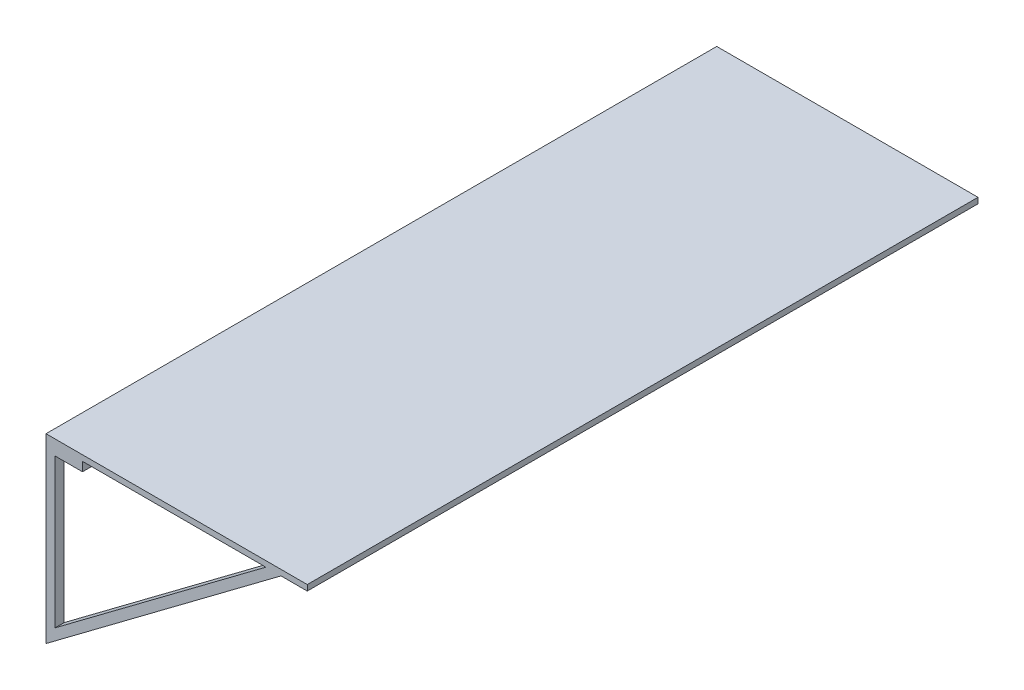
ISO-10303-21;
HEADER;
FILE_DESCRIPTION(('STEP AP214'),'2;1');
FILE_NAME('part.step','',(''),(''),'','','');
FILE_SCHEMA(('AUTOMOTIVE_DESIGN { 1 0 10303 214 1 1 1 1 }'));
ENDSEC;
DATA;
#1=APPLICATION_CONTEXT('core data for automotive mechanical design processes');
#2=APPLICATION_PROTOCOL_DEFINITION('international standard','automotive_design',2000,#1);
#3=PRODUCT_CONTEXT('',#1,'mechanical');
#4=PRODUCT('Part','Part','',(#3));
#5=PRODUCT_RELATED_PRODUCT_CATEGORY('part','',(#4));
#6=PRODUCT_DEFINITION_FORMATION('','',#4);
#7=PRODUCT_DEFINITION_CONTEXT('part definition',#1,'design');
#8=PRODUCT_DEFINITION('design','',#6,#7);
#9=PRODUCT_DEFINITION_SHAPE('','',#8);
#10=(LENGTH_UNIT() NAMED_UNIT(*) SI_UNIT(.MILLI.,.METRE.));
#11=(NAMED_UNIT(*) PLANE_ANGLE_UNIT() SI_UNIT($,.RADIAN.));
#12=(NAMED_UNIT(*) SI_UNIT($,.STERADIAN.) SOLID_ANGLE_UNIT());
#13=UNCERTAINTY_MEASURE_WITH_UNIT(LENGTH_MEASURE(1.E-05),#10,'distance_accuracy_value','');
#14=(GEOMETRIC_REPRESENTATION_CONTEXT(3) GLOBAL_UNCERTAINTY_ASSIGNED_CONTEXT((#13)) GLOBAL_UNIT_ASSIGNED_CONTEXT((#10,
#11,#12)) REPRESENTATION_CONTEXT('',''));
#15=CARTESIAN_POINT('',(0.,0.,0.));
#16=DIRECTION('',(0.,0.,1.));
#17=DIRECTION('',(1.,0.,0.));
#18=AXIS2_PLACEMENT_3D('',#15,#16,#17);
#19=CARTESIAN_POINT('',(0.,0.,1874.774));
#20=DIRECTION('',(-0.599619449043506,0.800285271842961,0.));
#21=DIRECTION('',(-0.800285271842961,-0.599619449043506,0.));
#22=AXIS2_PLACEMENT_3D('',#19,#20,#21);
#23=PLANE('',#22);
#24=DIRECTION('',(0.,0.,-1.));
#25=VECTOR('',#24,1.);
#26=CARTESIAN_POINT('',(0.,0.,1874.774));
#27=LINE('',#26,#25);
#28=CARTESIAN_POINT('',(0.,0.,950.087));
#29=VERTEX_POINT('',#28);
#30=CARTESIAN_POINT('',(0.,0.,924.687));
#31=VERTEX_POINT('',#30);
#32=EDGE_CURVE('E225',#29,#31,#27,.T.);
#33=ORIENTED_EDGE('',*,*,#32,.T.);
#34=DIRECTION('',(0.800285271842961,0.599619449043506,0.));
#35=VECTOR('',#34,1.);
#36=CARTESIAN_POINT('',(1.02853414321365E-13,0.,924.687));
#37=LINE('',#36,#35);
#38=CARTESIAN_POINT('',(656.817236388778,492.125,924.687));
#39=VERTEX_POINT('',#38);
#40=EDGE_CURVE('E208',#31,#39,#37,.T.);
#41=ORIENTED_EDGE('',*,*,#40,.T.);
#42=DIRECTION('',(0.,0.,-1.));
#43=VECTOR('',#42,1.);
#44=CARTESIAN_POINT('',(656.817236388778,492.125,1874.774));
#45=LINE('',#44,#43);
#46=CARTESIAN_POINT('',(656.817236388778,492.125,950.087));
#47=VERTEX_POINT('',#46);
#48=EDGE_CURVE('E253',#47,#39,#45,.T.);
#49=ORIENTED_EDGE('',*,*,#48,.F.);
#50=DIRECTION('',(-0.800285271842961,-0.599619449043506,0.));
#51=VECTOR('',#50,1.);
#52=CARTESIAN_POINT('',(-1.00103690639468E-13,0.,950.087));
#53=LINE('',#52,#51);
#54=EDGE_CURVE('E230',#47,#29,#53,.T.);
#55=ORIENTED_EDGE('',*,*,#54,.T.);
#56=EDGE_LOOP('',(#33,#41,#49,#55));
#57=FACE_BOUND('',#56,.T.);
#58=ADVANCED_FACE('F35',(#57),#23,.F.);
#59=CARTESIAN_POINT('',(101.981819436468,492.125,1874.774));
#60=DIRECTION('',(1.,0.,0.));
#61=DIRECTION('',(0.,0.,-1.));
#62=AXIS2_PLACEMENT_3D('',#59,#60,#61);
#63=PLANE('',#62);
#64=DIRECTION('',(0.,-1.,0.));
#65=VECTOR('',#64,1.);
#66=CARTESIAN_POINT('',(101.981819436468,492.125,924.687));
#67=LINE('',#66,#65);
#68=CARTESIAN_POINT('',(101.981819436468,492.125,924.687));
#69=VERTEX_POINT('',#68);
#70=CARTESIAN_POINT('',(101.981819436468,466.725,924.687));
#71=VERTEX_POINT('',#70);
#72=EDGE_CURVE('E219',#69,#71,#67,.T.);
#73=ORIENTED_EDGE('',*,*,#72,.F.);
#74=DIRECTION('',(0.,0.,-1.));
#75=VECTOR('',#74,1.);
#76=CARTESIAN_POINT('',(101.981819436468,492.125,1874.774));
#77=LINE('',#76,#75);
#78=CARTESIAN_POINT('',(101.981819436468,492.125,950.087));
#79=VERTEX_POINT('',#78);
#80=EDGE_CURVE('E315',#79,#69,#77,.T.);
#81=ORIENTED_EDGE('',*,*,#80,.F.);
#82=DIRECTION('',(0.,1.,0.));
#83=VECTOR('',#82,1.);
#84=CARTESIAN_POINT('',(101.981819436468,492.125,950.087));
#85=LINE('',#84,#83);
#86=CARTESIAN_POINT('',(101.981819436468,466.725,950.087));
#87=VERTEX_POINT('',#86);
#88=EDGE_CURVE('E401',#87,#79,#85,.T.);
#89=ORIENTED_EDGE('',*,*,#88,.F.);
#90=DIRECTION('',(0.,0.,-1.));
#91=VECTOR('',#90,1.);
#92=CARTESIAN_POINT('',(101.981819436468,466.725,1874.774));
#93=LINE('',#92,#91);
#94=EDGE_CURVE('E302',#87,#71,#93,.T.);
#95=ORIENTED_EDGE('',*,*,#94,.T.);
#96=EDGE_LOOP('',(#73,#81,#89,#95));
#97=FACE_BOUND('',#96,.T.);
#98=ADVANCED_FACE('F452',(#97),#63,.T.);
#99=CARTESIAN_POINT('',(101.981819436468,466.725,1874.774));
#100=DIRECTION('',(0.,-1.,0.));
#101=DIRECTION('',(0.,0.,-1.));
#102=AXIS2_PLACEMENT_3D('',#99,#100,#101);
#103=PLANE('',#102);
#104=DIRECTION('',(-1.,0.,0.));
#105=VECTOR('',#104,1.);
#106=CARTESIAN_POINT('',(101.981819436468,466.725,924.687));
#107=LINE('',#106,#105);
#108=CARTESIAN_POINT('',(25.4,466.725,924.687));
#109=VERTEX_POINT('',#108);
#110=EDGE_CURVE('E442',#71,#109,#107,.T.);
#111=ORIENTED_EDGE('',*,*,#110,.F.);
#112=ORIENTED_EDGE('',*,*,#94,.F.);
#113=DIRECTION('',(1.,0.,0.));
#114=VECTOR('',#113,1.);
#115=CARTESIAN_POINT('',(101.981819436468,466.725,950.087));
#116=LINE('',#115,#114);
#117=CARTESIAN_POINT('',(25.4,466.725,950.087));
#118=VERTEX_POINT('',#117);
#119=EDGE_CURVE('E399',#118,#87,#116,.T.);
#120=ORIENTED_EDGE('',*,*,#119,.F.);
#121=DIRECTION('',(0.,0.,-1.));
#122=VECTOR('',#121,1.);
#123=CARTESIAN_POINT('',(25.4,466.725,1874.774));
#124=LINE('',#123,#122);
#125=EDGE_CURVE('E291',#118,#109,#124,.T.);
#126=ORIENTED_EDGE('',*,*,#125,.T.);
#127=EDGE_LOOP('',(#111,#112,#120,#126));
#128=FACE_BOUND('',#127,.T.);
#129=ADVANCED_FACE('F457',(#128),#103,.T.);
#130=CARTESIAN_POINT('',(25.4,466.725,1874.774));
#131=DIRECTION('',(1.,0.,0.));
#132=DIRECTION('',(0.,1.,0.));
#133=AXIS2_PLACEMENT_3D('',#130,#131,#132);
#134=PLANE('',#133);
#135=DIRECTION('',(0.,-1.,0.));
#136=VECTOR('',#135,1.);
#137=CARTESIAN_POINT('',(25.4,466.725,924.687));
#138=LINE('',#137,#136);
#139=CARTESIAN_POINT('',(25.4000000000001,50.769813509298,924.687));
#140=VERTEX_POINT('',#139);
#141=EDGE_CURVE('E440',#109,#140,#138,.T.);
#142=ORIENTED_EDGE('',*,*,#141,.F.);
#143=ORIENTED_EDGE('',*,*,#125,.F.);
#144=DIRECTION('',(0.,1.,0.));
#145=VECTOR('',#144,1.);
#146=CARTESIAN_POINT('',(25.4,466.725,950.087));
#147=LINE('',#146,#145);
#148=CARTESIAN_POINT('',(25.4000000000001,50.769813509298,950.087));
#149=VERTEX_POINT('',#148);
#150=EDGE_CURVE('E397',#149,#118,#147,.T.);
#151=ORIENTED_EDGE('',*,*,#150,.F.);
#152=DIRECTION('',(0.,0.,-1.));
#153=VECTOR('',#152,1.);
#154=CARTESIAN_POINT('',(25.4000000000001,50.769813509298,1874.774));
#155=LINE('',#154,#153);
#156=EDGE_CURVE('E277',#149,#140,#155,.T.);
#157=ORIENTED_EDGE('',*,*,#156,.T.);
#158=EDGE_LOOP('',(#142,#143,#151,#157));
#159=FACE_BOUND('',#158,.T.);
#160=ADVANCED_FACE('F462',(#159),#134,.T.);
#161=CARTESIAN_POINT('',(614.457036030839,492.125,1874.774));
#162=DIRECTION('',(-0.599619449043506,0.800285271842961,0.));
#163=DIRECTION('',(-0.800285271842961,-0.599619449043506,0.));
#164=AXIS2_PLACEMENT_3D('',#161,#162,#163);
#165=PLANE('',#164);
#166=DIRECTION('',(0.800285271842961,0.599619449043506,0.));
#167=VECTOR('',#166,1.);
#168=CARTESIAN_POINT('',(614.457036030839,492.125,924.687));
#169=LINE('',#168,#167);
#170=CARTESIAN_POINT('',(614.457036030839,492.125,924.687));
#171=VERTEX_POINT('',#170);
#172=EDGE_CURVE('E11',#140,#171,#169,.T.);
#173=ORIENTED_EDGE('',*,*,#172,.F.);
#174=ORIENTED_EDGE('',*,*,#156,.F.);
#175=DIRECTION('',(-0.800285271842961,-0.599619449043506,0.));
#176=VECTOR('',#175,1.);
#177=CARTESIAN_POINT('',(614.457036030839,492.125,950.087));
#178=LINE('',#177,#176);
#179=CARTESIAN_POINT('',(614.457036030839,492.125,950.087));
#180=VERTEX_POINT('',#179);
#181=EDGE_CURVE('E252',#180,#149,#178,.T.);
#182=ORIENTED_EDGE('',*,*,#181,.F.);
#183=DIRECTION('',(0.,0.,-1.));
#184=VECTOR('',#183,1.);
#185=CARTESIAN_POINT('',(614.457036030839,492.125,1874.774));
#186=LINE('',#185,#184);
#187=EDGE_CURVE('E283',#180,#171,#186,.T.);
#188=ORIENTED_EDGE('',*,*,#187,.T.);
#189=EDGE_LOOP('',(#173,#174,#182,#188));
#190=FACE_BOUND('',#189,.T.);
#191=ADVANCED_FACE('F466',(#190),#165,.T.);
#192=CARTESIAN_POINT('',(0.,0.,1874.774));
#193=VERTEX_POINT('',#192);
#194=CARTESIAN_POINT('',(0.,0.,1849.374));
#195=VERTEX_POINT('',#194);
#196=EDGE_CURVE('E231',#193,#195,#27,.T.);
#197=ORIENTED_EDGE('',*,*,#196,.T.);
#198=DIRECTION('',(0.800285271842961,0.599619449043506,0.));
#199=VECTOR('',#198,1.);
#200=CARTESIAN_POINT('',(0.,0.,1849.374));
#201=LINE('',#200,#199);
#202=CARTESIAN_POINT('',(656.817236388778,492.125,1849.374));
#203=VERTEX_POINT('',#202);
#204=EDGE_CURVE('E364',#195,#203,#201,.T.);
#205=ORIENTED_EDGE('',*,*,#204,.T.);
#206=CARTESIAN_POINT('',(656.817236388778,492.125,1874.774));
#207=VERTEX_POINT('',#206);
#208=EDGE_CURVE('E249',#207,#203,#45,.T.);
#209=ORIENTED_EDGE('',*,*,#208,.F.);
#210=DIRECTION('',(0.800285271842961,0.599619449043506,0.));
#211=VECTOR('',#210,1.);
#212=CARTESIAN_POINT('',(0.,0.,1874.774));
#213=LINE('',#212,#211);
#214=EDGE_CURVE('E341',#193,#207,#213,.T.);
#215=ORIENTED_EDGE('',*,*,#214,.F.);
#216=EDGE_LOOP('',(#197,#205,#209,#215));
#217=FACE_BOUND('',#216,.T.);
#218=ADVANCED_FACE('F363',(#217),#23,.F.);
#219=DIRECTION('',(0.,-1.,0.));
#220=VECTOR('',#219,1.);
#221=CARTESIAN_POINT('',(101.981819436468,492.125,1849.374));
#222=LINE('',#221,#220);
#223=CARTESIAN_POINT('',(101.981819436468,492.125,1849.374));
#224=VERTEX_POINT('',#223);
#225=CARTESIAN_POINT('',(101.981819436468,466.725,1849.374));
#226=VERTEX_POINT('',#225);
#227=EDGE_CURVE('E408',#224,#226,#222,.T.);
#228=ORIENTED_EDGE('',*,*,#227,.F.);
#229=CARTESIAN_POINT('',(101.981819436468,492.125,1874.774));
#230=VERTEX_POINT('',#229);
#231=EDGE_CURVE('E316',#230,#224,#77,.T.);
#232=ORIENTED_EDGE('',*,*,#231,.F.);
#233=DIRECTION('',(0.,-1.,0.));
#234=VECTOR('',#233,1.);
#235=CARTESIAN_POINT('',(101.981819436468,492.125,1874.774));
#236=LINE('',#235,#234);
#237=CARTESIAN_POINT('',(101.981819436468,466.725,1874.774));
#238=VERTEX_POINT('',#237);
#239=EDGE_CURVE('E414',#230,#238,#236,.T.);
#240=ORIENTED_EDGE('',*,*,#239,.T.);
#241=EDGE_CURVE('E303',#238,#226,#93,.T.);
#242=ORIENTED_EDGE('',*,*,#241,.T.);
#243=EDGE_LOOP('',(#228,#232,#240,#242));
#244=FACE_BOUND('',#243,.T.);
#245=ADVANCED_FACE('F474',(#244),#63,.T.);
#246=DIRECTION('',(-1.,0.,0.));
#247=VECTOR('',#246,1.);
#248=CARTESIAN_POINT('',(101.981819436468,466.725,1849.374));
#249=LINE('',#248,#247);
#250=CARTESIAN_POINT('',(25.4,466.725,1849.374));
#251=VERTEX_POINT('',#250);
#252=EDGE_CURVE('E406',#226,#251,#249,.T.);
#253=ORIENTED_EDGE('',*,*,#252,.F.);
#254=ORIENTED_EDGE('',*,*,#241,.F.);
#255=DIRECTION('',(-1.,0.,0.));
#256=VECTOR('',#255,1.);
#257=CARTESIAN_POINT('',(101.981819436468,466.725,1874.774));
#258=LINE('',#257,#256);
#259=CARTESIAN_POINT('',(25.4,466.725,1874.774));
#260=VERTEX_POINT('',#259);
#261=EDGE_CURVE('E416',#238,#260,#258,.T.);
#262=ORIENTED_EDGE('',*,*,#261,.T.);
#263=EDGE_CURVE('E292',#260,#251,#124,.T.);
#264=ORIENTED_EDGE('',*,*,#263,.T.);
#265=EDGE_LOOP('',(#253,#254,#262,#264));
#266=FACE_BOUND('',#265,.T.);
#267=ADVANCED_FACE('F528',(#266),#103,.T.);
#268=DIRECTION('',(0.,-1.,0.));
#269=VECTOR('',#268,1.);
#270=CARTESIAN_POINT('',(25.4,466.725,1849.374));
#271=LINE('',#270,#269);
#272=CARTESIAN_POINT('',(25.4000000000001,50.769813509298,1849.374));
#273=VERTEX_POINT('',#272);
#274=EDGE_CURVE('E404',#251,#273,#271,.T.);
#275=ORIENTED_EDGE('',*,*,#274,.F.);
#276=ORIENTED_EDGE('',*,*,#263,.F.);
#277=DIRECTION('',(0.,-1.,0.));
#278=VECTOR('',#277,1.);
#279=CARTESIAN_POINT('',(25.4,466.725,1874.774));
#280=LINE('',#279,#278);
#281=CARTESIAN_POINT('',(25.4,50.769813509298,1874.774));
#282=VERTEX_POINT('',#281);
#283=EDGE_CURVE('E418',#260,#282,#280,.T.);
#284=ORIENTED_EDGE('',*,*,#283,.T.);
#285=EDGE_CURVE('E280',#282,#273,#155,.T.);
#286=ORIENTED_EDGE('',*,*,#285,.T.);
#287=EDGE_LOOP('',(#275,#276,#284,#286));
#288=FACE_BOUND('',#287,.T.);
#289=ADVANCED_FACE('F476',(#288),#134,.T.);
#290=DIRECTION('',(0.800285271842961,0.599619449043506,0.));
#291=VECTOR('',#290,1.);
#292=CARTESIAN_POINT('',(614.457036030839,492.125,1849.374));
#293=LINE('',#292,#291);
#294=CARTESIAN_POINT('',(614.457036030839,492.125,1849.374));
#295=VERTEX_POINT('',#294);
#296=EDGE_CURVE('E255',#273,#295,#293,.T.);
#297=ORIENTED_EDGE('',*,*,#296,.F.);
#298=ORIENTED_EDGE('',*,*,#285,.F.);
#299=DIRECTION('',(0.800285271842961,0.599619449043506,0.));
#300=VECTOR('',#299,1.);
#301=CARTESIAN_POINT('',(614.457036030839,492.125,1874.774));
#302=LINE('',#301,#300);
#303=CARTESIAN_POINT('',(614.457036030839,492.125,1874.774));
#304=VERTEX_POINT('',#303);
#305=EDGE_CURVE('E420',#282,#304,#302,.T.);
#306=ORIENTED_EDGE('',*,*,#305,.T.);
#307=EDGE_CURVE('E278',#304,#295,#186,.T.);
#308=ORIENTED_EDGE('',*,*,#307,.T.);
#309=EDGE_LOOP('',(#297,#298,#306,#308));
#310=FACE_BOUND('',#309,.T.);
#311=ADVANCED_FACE('F469',(#310),#165,.T.);
#312=CARTESIAN_POINT('',(0.,0.,1874.774));
#313=DIRECTION('',(0.,0.,1.));
#314=DIRECTION('',(1.,0.,0.));
#315=AXIS2_PLACEMENT_3D('',#312,#313,#314);
#316=PLANE('',#315);
#317=ORIENTED_EDGE('',*,*,#214,.T.);
#318=DIRECTION('',(1.,0.,0.));
#319=VECTOR('',#318,1.);
#320=CARTESIAN_POINT('',(730.25,492.125,1874.774));
#321=LINE('',#320,#319);
#322=CARTESIAN_POINT('',(730.25,492.125,1874.774));
#323=VERTEX_POINT('',#322);
#324=EDGE_CURVE('E345',#207,#323,#321,.T.);
#325=ORIENTED_EDGE('',*,*,#324,.T.);
#326=DIRECTION('',(0.,1.,0.));
#327=VECTOR('',#326,1.);
#328=CARTESIAN_POINT('',(730.25,492.125,1874.774));
#329=LINE('',#328,#327);
#330=CARTESIAN_POINT('',(730.25,508.,1874.774));
#331=VERTEX_POINT('',#330);
#332=EDGE_CURVE('E349',#323,#331,#329,.T.);
#333=ORIENTED_EDGE('',*,*,#332,.T.);
#334=DIRECTION('',(-1.,0.,0.));
#335=VECTOR('',#334,1.);
#336=CARTESIAN_POINT('',(0.,508.,1874.774));
#337=LINE('',#336,#335);
#338=CARTESIAN_POINT('',(0.,508.,1874.774));
#339=VERTEX_POINT('',#338);
#340=EDGE_CURVE('E352',#331,#339,#337,.T.);
#341=ORIENTED_EDGE('',*,*,#340,.T.);
#342=DIRECTION('',(0.,-1.,0.));
#343=VECTOR('',#342,1.);
#344=CARTESIAN_POINT('',(0.,0.,1874.774));
#345=LINE('',#344,#343);
#346=EDGE_CURVE('E236',#339,#193,#345,.T.);
#347=ORIENTED_EDGE('',*,*,#346,.T.);
#348=EDGE_LOOP('',(#317,#325,#333,#341,#347));
#349=FACE_BOUND('',#348,.T.);
#350=ORIENTED_EDGE('',*,*,#239,.F.);
#351=DIRECTION('',(-1.,0.,0.));
#352=VECTOR('',#351,1.);
#353=CARTESIAN_POINT('',(614.457036030839,492.125,1874.774));
#354=LINE('',#353,#352);
#355=EDGE_CURVE('E412',#304,#230,#354,.T.);
#356=ORIENTED_EDGE('',*,*,#355,.F.);
#357=ORIENTED_EDGE('',*,*,#305,.F.);
#358=ORIENTED_EDGE('',*,*,#283,.F.);
#359=ORIENTED_EDGE('',*,*,#261,.F.);
#360=EDGE_LOOP('',(#350,#356,#357,#358,#359));
#361=FACE_BOUND('',#360,.T.);
#362=ADVANCED_FACE('F356',(#349,#361),#316,.T.);
#363=CARTESIAN_POINT('',(0.,0.,0.));
#364=DIRECTION('',(0.,0.,1.));
#365=DIRECTION('',(1.,0.,0.));
#366=AXIS2_PLACEMENT_3D('',#363,#364,#365);
#367=PLANE('',#366);
#368=DIRECTION('',(0.800285271842961,0.599619449043506,0.));
#369=VECTOR('',#368,1.);
#370=CARTESIAN_POINT('',(0.,0.,0.));
#371=LINE('',#370,#369);
#372=CARTESIAN_POINT('',(0.,0.,0.));
#373=VERTEX_POINT('',#372);
#374=CARTESIAN_POINT('',(656.817236388778,492.125,0.));
#375=VERTEX_POINT('',#374);
#376=EDGE_CURVE('E322',#373,#375,#371,.T.);
#377=ORIENTED_EDGE('',*,*,#376,.F.);
#378=DIRECTION('',(0.,-1.,0.));
#379=VECTOR('',#378,1.);
#380=CARTESIAN_POINT('',(0.,0.,0.));
#381=LINE('',#380,#379);
#382=CARTESIAN_POINT('',(0.,508.,0.));
#383=VERTEX_POINT('',#382);
#384=EDGE_CURVE('E239',#383,#373,#381,.T.);
#385=ORIENTED_EDGE('',*,*,#384,.F.);
#386=DIRECTION('',(-1.,0.,0.));
#387=VECTOR('',#386,1.);
#388=CARTESIAN_POINT('',(0.,508.,0.));
#389=LINE('',#388,#387);
#390=CARTESIAN_POINT('',(730.25,508.,0.));
#391=VERTEX_POINT('',#390);
#392=EDGE_CURVE('E336',#391,#383,#389,.T.);
#393=ORIENTED_EDGE('',*,*,#392,.F.);
#394=DIRECTION('',(0.,1.,0.));
#395=VECTOR('',#394,1.);
#396=CARTESIAN_POINT('',(730.25,492.125,0.));
#397=LINE('',#396,#395);
#398=CARTESIAN_POINT('',(730.25,492.125,0.));
#399=VERTEX_POINT('',#398);
#400=EDGE_CURVE('E331',#399,#391,#397,.T.);
#401=ORIENTED_EDGE('',*,*,#400,.F.);
#402=DIRECTION('',(1.,0.,0.));
#403=VECTOR('',#402,1.);
#404=CARTESIAN_POINT('',(730.25,492.125,0.));
#405=LINE('',#404,#403);
#406=EDGE_CURVE('E325',#375,#399,#405,.T.);
#407=ORIENTED_EDGE('',*,*,#406,.F.);
#408=EDGE_LOOP('',(#377,#385,#393,#401,#407));
#409=FACE_BOUND('',#408,.T.);
#410=DIRECTION('',(-1.,0.,0.));
#411=VECTOR('',#410,1.);
#412=CARTESIAN_POINT('',(614.457036030839,492.125,0.));
#413=LINE('',#412,#411);
#414=CARTESIAN_POINT('',(614.457036030839,492.125,0.));
#415=VERTEX_POINT('',#414);
#416=CARTESIAN_POINT('',(101.981819436468,492.125,0.));
#417=VERTEX_POINT('',#416);
#418=EDGE_CURVE('E411',#415,#417,#413,.T.);
#419=ORIENTED_EDGE('',*,*,#418,.T.);
#420=DIRECTION('',(0.,-1.,0.));
#421=VECTOR('',#420,1.);
#422=CARTESIAN_POINT('',(101.981819436468,492.125,0.));
#423=LINE('',#422,#421);
#424=CARTESIAN_POINT('',(101.981819436468,466.725,0.));
#425=VERTEX_POINT('',#424);
#426=EDGE_CURVE('E424',#417,#425,#423,.T.);
#427=ORIENTED_EDGE('',*,*,#426,.T.);
#428=DIRECTION('',(-1.,0.,0.));
#429=VECTOR('',#428,1.);
#430=CARTESIAN_POINT('',(101.981819436468,466.725,0.));
#431=LINE('',#430,#429);
#432=CARTESIAN_POINT('',(25.4,466.725,0.));
#433=VERTEX_POINT('',#432);
#434=EDGE_CURVE('E427',#425,#433,#431,.T.);
#435=ORIENTED_EDGE('',*,*,#434,.T.);
#436=DIRECTION('',(0.,-1.,0.));
#437=VECTOR('',#436,1.);
#438=CARTESIAN_POINT('',(25.4,466.725,0.));
#439=LINE('',#438,#437);
#440=CARTESIAN_POINT('',(25.4000000000001,50.769813509298,0.));
#441=VERTEX_POINT('',#440);
#442=EDGE_CURVE('E430',#433,#441,#439,.T.);
#443=ORIENTED_EDGE('',*,*,#442,.T.);
#444=DIRECTION('',(0.800285271842961,0.599619449043506,0.));
#445=VECTOR('',#444,1.);
#446=CARTESIAN_POINT('',(614.457036030839,492.125,0.));
#447=LINE('',#446,#445);
#448=EDGE_CURVE('E275',#441,#415,#447,.T.);
#449=ORIENTED_EDGE('',*,*,#448,.T.);
#450=EDGE_LOOP('',(#419,#427,#435,#443,#449));
#451=FACE_BOUND('',#450,.T.);
#452=ADVANCED_FACE('F378',(#409,#451),#367,.F.);
#453=CARTESIAN_POINT('',(656.817236388778,492.125,25.4));
#454=VERTEX_POINT('',#453);
#455=EDGE_CURVE('E248',#454,#375,#45,.T.);
#456=ORIENTED_EDGE('',*,*,#455,.F.);
#457=DIRECTION('',(-0.800285271842961,-0.599619449043506,0.));
#458=VECTOR('',#457,1.);
#459=CARTESIAN_POINT('',(-2.00207381278936E-13,-1.5000680867269E-13,25.3999999999999));
#460=LINE('',#459,#458);
#461=CARTESIAN_POINT('',(0.,0.,25.4000000000001));
#462=VERTEX_POINT('',#461);
#463=EDGE_CURVE('E435',#454,#462,#460,.T.);
#464=ORIENTED_EDGE('',*,*,#463,.T.);
#465=EDGE_CURVE('E232',#462,#373,#27,.T.);
#466=ORIENTED_EDGE('',*,*,#465,.T.);
#467=ORIENTED_EDGE('',*,*,#376,.T.);
#468=EDGE_LOOP('',(#456,#464,#466,#467));
#469=FACE_BOUND('',#468,.T.);
#470=ADVANCED_FACE('F37',(#469),#23,.F.);
#471=CARTESIAN_POINT('',(730.25,492.125,1874.774));
#472=DIRECTION('',(0.,1.,0.));
#473=DIRECTION('',(0.,0.,1.));
#474=AXIS2_PLACEMENT_3D('',#471,#472,#473);
#475=PLANE('',#474);
#476=DIRECTION('',(1.,0.,0.));
#477=VECTOR('',#476,1.);
#478=CARTESIAN_POINT('',(0.,492.125,25.4));
#479=LINE('',#478,#477);
#480=CARTESIAN_POINT('',(614.457036030839,492.125,25.3999999999999));
#481=VERTEX_POINT('',#480);
#482=EDGE_CURVE('E58',#481,#454,#479,.T.);
#483=ORIENTED_EDGE('',*,*,#482,.T.);
#484=ORIENTED_EDGE('',*,*,#455,.T.);
#485=ORIENTED_EDGE('',*,*,#406,.T.);
#486=DIRECTION('',(0.,0.,-1.));
#487=VECTOR('',#486,1.);
#488=CARTESIAN_POINT('',(730.25,492.125,1874.774));
#489=LINE('',#488,#487);
#490=EDGE_CURVE('E246',#323,#399,#489,.T.);
#491=ORIENTED_EDGE('',*,*,#490,.F.);
#492=ORIENTED_EDGE('',*,*,#324,.F.);
#493=ORIENTED_EDGE('',*,*,#208,.T.);
#494=DIRECTION('',(1.,0.,0.));
#495=VECTOR('',#494,1.);
#496=CARTESIAN_POINT('',(0.,492.125,1849.374));
#497=LINE('',#496,#495);
#498=EDGE_CURVE('E369',#295,#203,#497,.T.);
#499=ORIENTED_EDGE('',*,*,#498,.F.);
#500=ORIENTED_EDGE('',*,*,#307,.F.);
#501=ORIENTED_EDGE('',*,*,#355,.T.);
#502=ORIENTED_EDGE('',*,*,#231,.T.);
#503=CARTESIAN_POINT('',(0.,492.125,1849.374));
#504=VERTEX_POINT('',#503);
#505=EDGE_CURVE('E396',#504,#224,#497,.T.);
#506=ORIENTED_EDGE('',*,*,#505,.F.);
#507=DIRECTION('',(0.,0.,1.));
#508=VECTOR('',#507,1.);
#509=CARTESIAN_POINT('',(0.,492.125,1849.374));
#510=LINE('',#509,#508);
#511=CARTESIAN_POINT('',(0.,492.125,950.087));
#512=VERTEX_POINT('',#511);
#513=EDGE_CURVE('E389',#512,#504,#510,.T.);
#514=ORIENTED_EDGE('',*,*,#513,.F.);
#515=DIRECTION('',(1.,0.,0.));
#516=VECTOR('',#515,1.);
#517=CARTESIAN_POINT('',(0.,492.125,950.087));
#518=LINE('',#517,#516);
#519=EDGE_CURVE('E388',#512,#79,#518,.T.);
#520=ORIENTED_EDGE('',*,*,#519,.T.);
#521=ORIENTED_EDGE('',*,*,#80,.T.);
#522=DIRECTION('',(1.,0.,0.));
#523=VECTOR('',#522,1.);
#524=CARTESIAN_POINT('',(0.,492.125,924.687));
#525=LINE('',#524,#523);
#526=CARTESIAN_POINT('',(0.,492.125,924.687));
#527=VERTEX_POINT('',#526);
#528=EDGE_CURVE('E271',#527,#69,#525,.T.);
#529=ORIENTED_EDGE('',*,*,#528,.F.);
#530=DIRECTION('',(0.,0.,1.));
#531=VECTOR('',#530,1.);
#532=CARTESIAN_POINT('',(0.,492.125,924.687));
#533=LINE('',#532,#531);
#534=CARTESIAN_POINT('',(0.,492.125,25.3999999999998));
#535=VERTEX_POINT('',#534);
#536=EDGE_CURVE('E50',#535,#527,#533,.T.);
#537=ORIENTED_EDGE('',*,*,#536,.F.);
#538=CARTESIAN_POINT('',(101.981819436468,492.125,25.4));
#539=VERTEX_POINT('',#538);
#540=EDGE_CURVE('E678',#535,#539,#479,.T.);
#541=ORIENTED_EDGE('',*,*,#540,.T.);
#542=EDGE_CURVE('E311',#539,#417,#77,.T.);
#543=ORIENTED_EDGE('',*,*,#542,.T.);
#544=ORIENTED_EDGE('',*,*,#418,.F.);
#545=EDGE_CURVE('E285',#481,#415,#186,.T.);
#546=ORIENTED_EDGE('',*,*,#545,.F.);
#547=EDGE_LOOP('',(#483,#484,#485,#491,#492,#493,#499,#500,#501,#502,#506,#514,#520,#521,#529,
#537,#541,#543,#544,#546));
#548=FACE_BOUND('',#547,.T.);
#549=ORIENTED_EDGE('',*,*,#48,.T.);
#550=EDGE_CURVE('E213',#171,#39,#525,.T.);
#551=ORIENTED_EDGE('',*,*,#550,.F.);
#552=ORIENTED_EDGE('',*,*,#187,.F.);
#553=EDGE_CURVE('E385',#180,#47,#518,.T.);
#554=ORIENTED_EDGE('',*,*,#553,.T.);
#555=EDGE_LOOP('',(#549,#551,#552,#554));
#556=FACE_BOUND('',#555,.T.);
#557=ADVANCED_FACE('F366',(#548,#556),#475,.F.);
#558=CARTESIAN_POINT('',(730.25,492.125,1874.774));
#559=DIRECTION('',(-1.,0.,0.));
#560=DIRECTION('',(0.,0.,1.));
#561=AXIS2_PLACEMENT_3D('',#558,#559,#560);
#562=PLANE('',#561);
#563=ORIENTED_EDGE('',*,*,#400,.T.);
#564=DIRECTION('',(0.,0.,-1.));
#565=VECTOR('',#564,1.);
#566=CARTESIAN_POINT('',(730.25,508.,1874.774));
#567=LINE('',#566,#565);
#568=EDGE_CURVE('E243',#331,#391,#567,.T.);
#569=ORIENTED_EDGE('',*,*,#568,.F.);
#570=ORIENTED_EDGE('',*,*,#332,.F.);
#571=ORIENTED_EDGE('',*,*,#490,.T.);
#572=EDGE_LOOP('',(#563,#569,#570,#571));
#573=FACE_BOUND('',#572,.T.);
#574=ADVANCED_FACE('F374',(#573),#562,.F.);
#575=CARTESIAN_POINT('',(0.,508.,1874.774));
#576=DIRECTION('',(0.,-1.,0.));
#577=DIRECTION('',(0.,0.,-1.));
#578=AXIS2_PLACEMENT_3D('',#575,#576,#577);
#579=PLANE('',#578);
#580=ORIENTED_EDGE('',*,*,#392,.T.);
#581=DIRECTION('',(0.,0.,-1.));
#582=VECTOR('',#581,1.);
#583=CARTESIAN_POINT('',(0.,508.,1874.774));
#584=LINE('',#583,#582);
#585=EDGE_CURVE('E235',#339,#383,#584,.T.);
#586=ORIENTED_EDGE('',*,*,#585,.F.);
#587=ORIENTED_EDGE('',*,*,#340,.F.);
#588=ORIENTED_EDGE('',*,*,#568,.T.);
#589=EDGE_LOOP('',(#580,#586,#587,#588));
#590=FACE_BOUND('',#589,.T.);
#591=ADVANCED_FACE('F376',(#590),#579,.F.);
#592=CARTESIAN_POINT('',(0.,0.,1874.774));
#593=DIRECTION('',(1.,0.,0.));
#594=DIRECTION('',(0.,0.,-1.));
#595=AXIS2_PLACEMENT_3D('',#592,#593,#594);
#596=PLANE('',#595);
#597=ORIENTED_EDGE('',*,*,#536,.T.);
#598=DIRECTION('',(0.,-1.,0.));
#599=VECTOR('',#598,1.);
#600=CARTESIAN_POINT('',(0.,492.125,924.687));
#601=LINE('',#600,#599);
#602=EDGE_CURVE('E211',#527,#31,#601,.T.);
#603=ORIENTED_EDGE('',*,*,#602,.T.);
#604=ORIENTED_EDGE('',*,*,#32,.F.);
#605=DIRECTION('',(0.,1.,0.));
#606=VECTOR('',#605,1.);
#607=CARTESIAN_POINT('',(0.,492.125,950.087));
#608=LINE('',#607,#606);
#609=EDGE_CURVE('E392',#29,#512,#608,.T.);
#610=ORIENTED_EDGE('',*,*,#609,.T.);
#611=ORIENTED_EDGE('',*,*,#513,.T.);
#612=DIRECTION('',(0.,-1.,0.));
#613=VECTOR('',#612,1.);
#614=CARTESIAN_POINT('',(0.,492.125,1849.374));
#615=LINE('',#614,#613);
#616=EDGE_CURVE('E218',#504,#195,#615,.T.);
#617=ORIENTED_EDGE('',*,*,#616,.T.);
#618=ORIENTED_EDGE('',*,*,#196,.F.);
#619=ORIENTED_EDGE('',*,*,#346,.F.);
#620=ORIENTED_EDGE('',*,*,#585,.T.);
#621=ORIENTED_EDGE('',*,*,#384,.T.);
#622=ORIENTED_EDGE('',*,*,#465,.F.);
#623=DIRECTION('',(0.,1.,0.));
#624=VECTOR('',#623,1.);
#625=CARTESIAN_POINT('',(0.,492.125,25.4));
#626=LINE('',#625,#624);
#627=EDGE_CURVE('E227',#462,#535,#626,.T.);
#628=ORIENTED_EDGE('',*,*,#627,.T.);
#629=EDGE_LOOP('',(#597,#603,#604,#610,#611,#617,#618,#619,#620,#621,#622,#628));
#630=FACE_BOUND('',#629,.T.);
#631=ADVANCED_FACE('F223',(#630),#596,.F.);
#632=DIRECTION('',(0.,1.,0.));
#633=VECTOR('',#632,1.);
#634=CARTESIAN_POINT('',(101.981819436468,492.124999999999,25.3999999999999));
#635=LINE('',#634,#633);
#636=CARTESIAN_POINT('',(101.981819436468,466.725,25.3999999999999));
#637=VERTEX_POINT('',#636);
#638=EDGE_CURVE('E433',#637,#539,#635,.T.);
#639=ORIENTED_EDGE('',*,*,#638,.F.);
#640=EDGE_CURVE('E298',#637,#425,#93,.T.);
#641=ORIENTED_EDGE('',*,*,#640,.T.);
#642=ORIENTED_EDGE('',*,*,#426,.F.);
#643=ORIENTED_EDGE('',*,*,#542,.F.);
#644=EDGE_LOOP('',(#639,#641,#642,#643));
#645=FACE_BOUND('',#644,.T.);
#646=ADVANCED_FACE('F487',(#645),#63,.T.);
#647=DIRECTION('',(1.,0.,0.));
#648=VECTOR('',#647,1.);
#649=CARTESIAN_POINT('',(101.981819436468,466.725,25.3999999999999));
#650=LINE('',#649,#648);
#651=CARTESIAN_POINT('',(25.4,466.725,25.3999999999999));
#652=VERTEX_POINT('',#651);
#653=EDGE_CURVE('E270',#652,#637,#650,.T.);
#654=ORIENTED_EDGE('',*,*,#653,.F.);
#655=EDGE_CURVE('E269',#652,#433,#124,.T.);
#656=ORIENTED_EDGE('',*,*,#655,.T.);
#657=ORIENTED_EDGE('',*,*,#434,.F.);
#658=ORIENTED_EDGE('',*,*,#640,.F.);
#659=EDGE_LOOP('',(#654,#656,#657,#658));
#660=FACE_BOUND('',#659,.T.);
#661=ADVANCED_FACE('F432',(#660),#103,.T.);
#662=DIRECTION('',(0.,1.,0.));
#663=VECTOR('',#662,1.);
#664=CARTESIAN_POINT('',(25.4,466.725,25.3999999999999));
#665=LINE('',#664,#663);
#666=CARTESIAN_POINT('',(25.4000000000001,50.769813509298,25.4));
#667=VERTEX_POINT('',#666);
#668=EDGE_CURVE('E258',#667,#652,#665,.T.);
#669=ORIENTED_EDGE('',*,*,#668,.F.);
#670=EDGE_CURVE('E267',#667,#441,#155,.T.);
#671=ORIENTED_EDGE('',*,*,#670,.T.);
#672=ORIENTED_EDGE('',*,*,#442,.F.);
#673=ORIENTED_EDGE('',*,*,#655,.F.);
#674=EDGE_LOOP('',(#669,#671,#672,#673));
#675=FACE_BOUND('',#674,.T.);
#676=ADVANCED_FACE('F265',(#675),#134,.T.);
#677=DIRECTION('',(-0.800285271842961,-0.599619449043506,0.));
#678=VECTOR('',#677,1.);
#679=CARTESIAN_POINT('',(614.457036030839,492.125,25.3999999999999));
#680=LINE('',#679,#678);
#681=EDGE_CURVE('E43',#481,#667,#680,.T.);
#682=ORIENTED_EDGE('',*,*,#681,.F.);
#683=ORIENTED_EDGE('',*,*,#545,.T.);
#684=ORIENTED_EDGE('',*,*,#448,.F.);
#685=ORIENTED_EDGE('',*,*,#670,.F.);
#686=EDGE_LOOP('',(#682,#683,#684,#685));
#687=FACE_BOUND('',#686,.T.);
#688=ADVANCED_FACE('F273',(#687),#165,.T.);
#689=CARTESIAN_POINT('',(0.,492.125,1849.374));
#690=DIRECTION('',(0.,0.,1.));
#691=DIRECTION('',(1.,0.,0.));
#692=AXIS2_PLACEMENT_3D('',#689,#690,#691);
#693=PLANE('',#692);
#694=ORIENTED_EDGE('',*,*,#616,.F.);
#695=ORIENTED_EDGE('',*,*,#505,.T.);
#696=ORIENTED_EDGE('',*,*,#227,.T.);
#697=ORIENTED_EDGE('',*,*,#252,.T.);
#698=ORIENTED_EDGE('',*,*,#274,.T.);
#699=ORIENTED_EDGE('',*,*,#296,.T.);
#700=ORIENTED_EDGE('',*,*,#498,.T.);
#701=ORIENTED_EDGE('',*,*,#204,.F.);
#702=EDGE_LOOP('',(#694,#695,#696,#697,#698,#699,#700,#701));
#703=FACE_BOUND('',#702,.T.);
#704=ADVANCED_FACE('F481',(#703),#693,.F.);
#705=CARTESIAN_POINT('',(0.,492.125,950.087));
#706=DIRECTION('',(0.,0.,-1.));
#707=DIRECTION('',(0.,1.,0.));
#708=AXIS2_PLACEMENT_3D('',#705,#706,#707);
#709=PLANE('',#708);
#710=ORIENTED_EDGE('',*,*,#553,.F.);
#711=ORIENTED_EDGE('',*,*,#181,.T.);
#712=ORIENTED_EDGE('',*,*,#150,.T.);
#713=ORIENTED_EDGE('',*,*,#119,.T.);
#714=ORIENTED_EDGE('',*,*,#88,.T.);
#715=ORIENTED_EDGE('',*,*,#519,.F.);
#716=ORIENTED_EDGE('',*,*,#609,.F.);
#717=ORIENTED_EDGE('',*,*,#54,.F.);
#718=EDGE_LOOP('',(#710,#711,#712,#713,#714,#715,#716,#717));
#719=FACE_BOUND('',#718,.T.);
#720=ADVANCED_FACE('F447',(#719),#709,.F.);
#721=CARTESIAN_POINT('',(0.,492.125,924.687));
#722=DIRECTION('',(0.,0.,1.));
#723=DIRECTION('',(0.,-1.,0.));
#724=AXIS2_PLACEMENT_3D('',#721,#722,#723);
#725=PLANE('',#724);
#726=ORIENTED_EDGE('',*,*,#602,.F.);
#727=ORIENTED_EDGE('',*,*,#528,.T.);
#728=ORIENTED_EDGE('',*,*,#72,.T.);
#729=ORIENTED_EDGE('',*,*,#110,.T.);
#730=ORIENTED_EDGE('',*,*,#141,.T.);
#731=ORIENTED_EDGE('',*,*,#172,.T.);
#732=ORIENTED_EDGE('',*,*,#550,.T.);
#733=ORIENTED_EDGE('',*,*,#40,.F.);
#734=EDGE_LOOP('',(#726,#727,#728,#729,#730,#731,#732,#733));
#735=FACE_BOUND('',#734,.T.);
#736=ADVANCED_FACE('F210',(#735),#725,.F.);
#737=CARTESIAN_POINT('',(0.,492.125,25.4));
#738=DIRECTION('',(0.,0.,-1.));
#739=DIRECTION('',(0.,1.,0.));
#740=AXIS2_PLACEMENT_3D('',#737,#738,#739);
#741=PLANE('',#740);
#742=ORIENTED_EDGE('',*,*,#482,.F.);
#743=ORIENTED_EDGE('',*,*,#681,.T.);
#744=ORIENTED_EDGE('',*,*,#668,.T.);
#745=ORIENTED_EDGE('',*,*,#653,.T.);
#746=ORIENTED_EDGE('',*,*,#638,.T.);
#747=ORIENTED_EDGE('',*,*,#540,.F.);
#748=ORIENTED_EDGE('',*,*,#627,.F.);
#749=ORIENTED_EDGE('',*,*,#463,.F.);
#750=EDGE_LOOP('',(#742,#743,#744,#745,#746,#747,#748,#749));
#751=FACE_BOUND('',#750,.T.);
#752=ADVANCED_FACE('F257',(#751),#741,.F.);
#753=CLOSED_SHELL('',(#58,#98,#129,#160,#191,#218,#245,#267,#289,#311,#362,#452,#470,#557,#574,
#591,#631,#646,#661,#676,#688,#704,#720,#736,#752));
#754=MANIFOLD_SOLID_BREP('B2',#753);
#755=ADVANCED_BREP_SHAPE_REPRESENTATION('',(#18,#754),#14);
#756=SHAPE_DEFINITION_REPRESENTATION(#9,#755);
ENDSEC;
END-ISO-10303-21;
